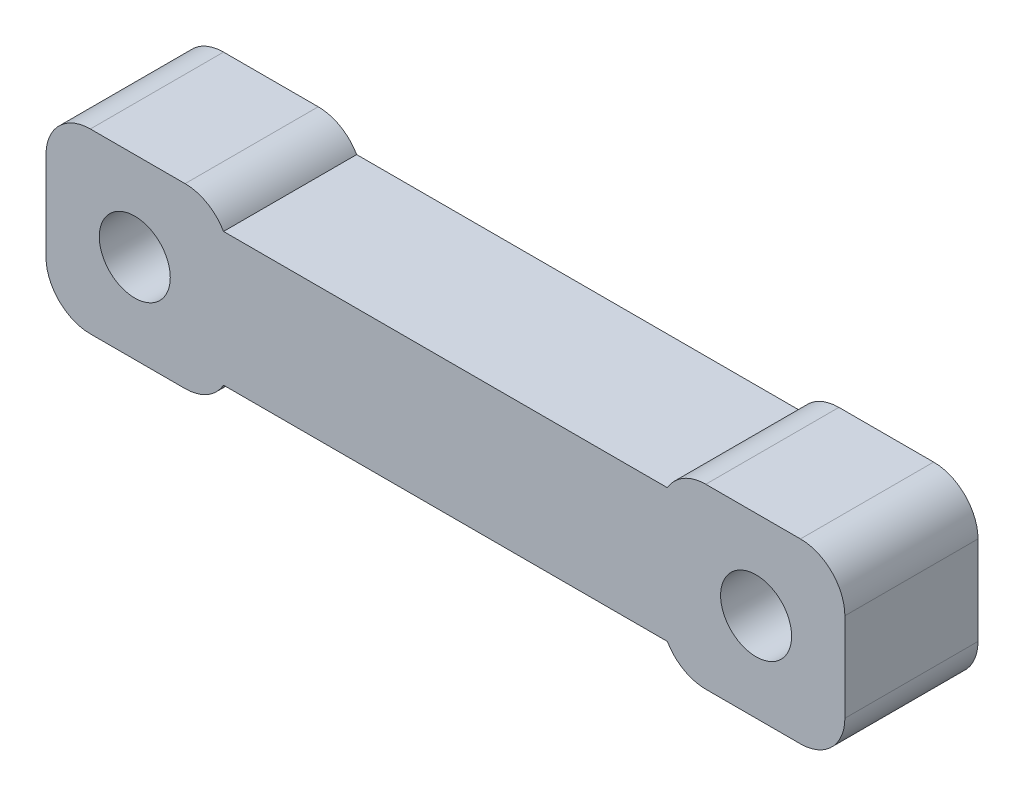
ISO-10303-21;
HEADER;
FILE_DESCRIPTION(('STEP AP214'),'2;1');
FILE_NAME('part.step','',(''),(''),'','','');
FILE_SCHEMA(('AUTOMOTIVE_DESIGN { 1 0 10303 214 1 1 1 1 }'));
ENDSEC;
DATA;
#1=APPLICATION_CONTEXT('core data for automotive mechanical design processes');
#2=APPLICATION_PROTOCOL_DEFINITION('international standard','automotive_design',2000,#1);
#3=PRODUCT_CONTEXT('',#1,'mechanical');
#4=PRODUCT('Part','Part','',(#3));
#5=PRODUCT_RELATED_PRODUCT_CATEGORY('part','',(#4));
#6=PRODUCT_DEFINITION_FORMATION('','',#4);
#7=PRODUCT_DEFINITION_CONTEXT('part definition',#1,'design');
#8=PRODUCT_DEFINITION('design','',#6,#7);
#9=PRODUCT_DEFINITION_SHAPE('','',#8);
#10=(LENGTH_UNIT() NAMED_UNIT(*) SI_UNIT(.MILLI.,.METRE.));
#11=(NAMED_UNIT(*) PLANE_ANGLE_UNIT() SI_UNIT($,.RADIAN.));
#12=(NAMED_UNIT(*) SI_UNIT($,.STERADIAN.) SOLID_ANGLE_UNIT());
#13=UNCERTAINTY_MEASURE_WITH_UNIT(LENGTH_MEASURE(1.E-05),#10,'distance_accuracy_value','');
#14=(GEOMETRIC_REPRESENTATION_CONTEXT(3) GLOBAL_UNCERTAINTY_ASSIGNED_CONTEXT((#13)) GLOBAL_UNIT_ASSIGNED_CONTEXT((#10,
#11,#12)) REPRESENTATION_CONTEXT('',''));
#15=CARTESIAN_POINT('',(0.,0.,0.));
#16=DIRECTION('',(0.,0.,1.));
#17=DIRECTION('',(1.,0.,0.));
#18=AXIS2_PLACEMENT_3D('',#15,#16,#17);
#19=CARTESIAN_POINT('',(0.,-2.,3.));
#20=DIRECTION('',(0.,-1.,0.));
#21=DIRECTION('',(1.,0.,0.));
#22=AXIS2_PLACEMENT_3D('',#19,#20,#21);
#23=PLANE('',#22);
#24=DIRECTION('',(-1.,0.,0.));
#25=VECTOR('',#24,1.);
#26=CARTESIAN_POINT('',(0.,-2.,3.));
#27=LINE('',#26,#25);
#28=CARTESIAN_POINT('',(8.,-2.,3.));
#29=VERTEX_POINT('',#28);
#30=CARTESIAN_POINT('',(5.86602540378444,-2.,3.));
#31=VERTEX_POINT('',#30);
#32=EDGE_CURVE('E285',#29,#31,#27,.T.);
#33=ORIENTED_EDGE('',*,*,#32,.T.);
#34=DIRECTION('',(0.,0.,1.));
#35=VECTOR('',#34,1.);
#36=CARTESIAN_POINT('',(5.86602540378444,-2.,0.));
#37=LINE('',#36,#35);
#38=CARTESIAN_POINT('',(5.86602540378444,-2.,0.));
#39=VERTEX_POINT('',#38);
#40=EDGE_CURVE('E179',#31,#39,#37,.F.);
#41=ORIENTED_EDGE('',*,*,#40,.T.);
#42=DIRECTION('',(-1.,0.,0.));
#43=VECTOR('',#42,1.);
#44=CARTESIAN_POINT('',(0.,-2.,0.));
#45=LINE('',#44,#43);
#46=CARTESIAN_POINT('',(8.,-2.,0.));
#47=VERTEX_POINT('',#46);
#48=EDGE_CURVE('E254',#47,#39,#45,.T.);
#49=ORIENTED_EDGE('',*,*,#48,.F.);
#50=DIRECTION('',(0.,0.,-1.));
#51=VECTOR('',#50,1.);
#52=CARTESIAN_POINT('',(8.,-2.,3.));
#53=LINE('',#52,#51);
#54=EDGE_CURVE('E177',#47,#29,#53,.F.);
#55=ORIENTED_EDGE('',*,*,#54,.T.);
#56=EDGE_LOOP('',(#33,#41,#49,#55));
#57=FACE_BOUND('',#56,.T.);
#58=ADVANCED_FACE('F38',(#57),#23,.T.);
#59=CARTESIAN_POINT('',(9.,0.,3.));
#60=DIRECTION('',(-1.,0.,0.));
#61=DIRECTION('',(0.,0.,1.));
#62=AXIS2_PLACEMENT_3D('',#59,#60,#61);
#63=PLANE('',#62);
#64=DIRECTION('',(0.,1.,0.));
#65=VECTOR('',#64,1.);
#66=CARTESIAN_POINT('',(9.,0.,3.));
#67=LINE('',#66,#65);
#68=CARTESIAN_POINT('',(9.,-0.999999999999999,3.));
#69=VERTEX_POINT('',#68);
#70=CARTESIAN_POINT('',(9.,1.,3.));
#71=VERTEX_POINT('',#70);
#72=EDGE_CURVE('E287',#69,#71,#67,.T.);
#73=ORIENTED_EDGE('',*,*,#72,.F.);
#74=DIRECTION('',(0.,0.,-1.));
#75=VECTOR('',#74,1.);
#76=CARTESIAN_POINT('',(9.,-0.999999999999999,0.));
#77=LINE('',#76,#75);
#78=CARTESIAN_POINT('',(9.,-0.999999999999999,0.));
#79=VERTEX_POINT('',#78);
#80=EDGE_CURVE('E215',#69,#79,#77,.T.);
#81=ORIENTED_EDGE('',*,*,#80,.T.);
#82=DIRECTION('',(0.,1.,0.));
#83=VECTOR('',#82,1.);
#84=CARTESIAN_POINT('',(9.,0.,0.));
#85=LINE('',#84,#83);
#86=CARTESIAN_POINT('',(9.,1.,0.));
#87=VERTEX_POINT('',#86);
#88=EDGE_CURVE('E307',#79,#87,#85,.T.);
#89=ORIENTED_EDGE('',*,*,#88,.T.);
#90=DIRECTION('',(0.,0.,-1.));
#91=VECTOR('',#90,1.);
#92=CARTESIAN_POINT('',(9.,1.,3.));
#93=LINE('',#92,#91);
#94=EDGE_CURVE('E213',#87,#71,#93,.F.);
#95=ORIENTED_EDGE('',*,*,#94,.T.);
#96=EDGE_LOOP('',(#73,#81,#89,#95));
#97=FACE_BOUND('',#96,.T.);
#98=ADVANCED_FACE('F335',(#97),#63,.F.);
#99=CARTESIAN_POINT('',(0.,2.,3.));
#100=DIRECTION('',(0.,-1.,0.));
#101=DIRECTION('',(1.,0.,0.));
#102=AXIS2_PLACEMENT_3D('',#99,#100,#101);
#103=PLANE('',#102);
#104=DIRECTION('',(-1.,0.,0.));
#105=VECTOR('',#104,1.);
#106=CARTESIAN_POINT('',(0.,2.,3.));
#107=LINE('',#106,#105);
#108=CARTESIAN_POINT('',(8.,2.,3.));
#109=VERTEX_POINT('',#108);
#110=CARTESIAN_POINT('',(5.86602540378444,2.,3.));
#111=VERTEX_POINT('',#110);
#112=EDGE_CURVE('E158',#109,#111,#107,.T.);
#113=ORIENTED_EDGE('',*,*,#112,.F.);
#114=DIRECTION('',(0.,0.,-1.));
#115=VECTOR('',#114,1.);
#116=CARTESIAN_POINT('',(8.,2.,3.));
#117=LINE('',#116,#115);
#118=CARTESIAN_POINT('',(8.,2.,0.));
#119=VERTEX_POINT('',#118);
#120=EDGE_CURVE('E220',#109,#119,#117,.T.);
#121=ORIENTED_EDGE('',*,*,#120,.T.);
#122=DIRECTION('',(-1.,0.,0.));
#123=VECTOR('',#122,1.);
#124=CARTESIAN_POINT('',(0.,2.,0.));
#125=LINE('',#124,#123);
#126=CARTESIAN_POINT('',(5.86602540378444,2.,0.));
#127=VERTEX_POINT('',#126);
#128=EDGE_CURVE('E257',#119,#127,#125,.T.);
#129=ORIENTED_EDGE('',*,*,#128,.T.);
#130=DIRECTION('',(0.,0.,1.));
#131=VECTOR('',#130,1.);
#132=CARTESIAN_POINT('',(5.86602540378444,2.,3.));
#133=LINE('',#132,#131);
#134=EDGE_CURVE('E218',#127,#111,#133,.T.);
#135=ORIENTED_EDGE('',*,*,#134,.T.);
#136=EDGE_LOOP('',(#113,#121,#129,#135));
#137=FACE_BOUND('',#136,.T.);
#138=ADVANCED_FACE('F339',(#137),#103,.F.);
#139=CARTESIAN_POINT('',(0.,1.5,3.));
#140=DIRECTION('',(0.,1.,0.));
#141=DIRECTION('',(0.,0.,1.));
#142=AXIS2_PLACEMENT_3D('',#139,#140,#141);
#143=PLANE('',#142);
#144=DIRECTION('',(1.,0.,0.));
#145=VECTOR('',#144,1.);
#146=CARTESIAN_POINT('',(0.,1.5,0.));
#147=LINE('',#146,#145);
#148=CARTESIAN_POINT('',(-5.,1.5,0.));
#149=VERTEX_POINT('',#148);
#150=CARTESIAN_POINT('',(5.,1.5,0.));
#151=VERTEX_POINT('',#150);
#152=EDGE_CURVE('E255',#149,#151,#147,.T.);
#153=ORIENTED_EDGE('',*,*,#152,.F.);
#154=DIRECTION('',(0.,0.,-1.));
#155=VECTOR('',#154,1.);
#156=CARTESIAN_POINT('',(-5.,1.5,3.));
#157=LINE('',#156,#155);
#158=CARTESIAN_POINT('',(-5.,1.5,3.));
#159=VERTEX_POINT('',#158);
#160=EDGE_CURVE('E172',#159,#149,#157,.T.);
#161=ORIENTED_EDGE('',*,*,#160,.F.);
#162=DIRECTION('',(1.,0.,0.));
#163=VECTOR('',#162,1.);
#164=CARTESIAN_POINT('',(0.,1.5,3.));
#165=LINE('',#164,#163);
#166=CARTESIAN_POINT('',(5.,1.5,3.));
#167=VERTEX_POINT('',#166);
#168=EDGE_CURVE('E155',#159,#167,#165,.T.);
#169=ORIENTED_EDGE('',*,*,#168,.T.);
#170=DIRECTION('',(0.,0.,-1.));
#171=VECTOR('',#170,1.);
#172=CARTESIAN_POINT('',(5.,1.5,3.));
#173=LINE('',#172,#171);
#174=EDGE_CURVE('E169',#167,#151,#173,.T.);
#175=ORIENTED_EDGE('',*,*,#174,.T.);
#176=EDGE_LOOP('',(#153,#161,#169,#175));
#177=FACE_BOUND('',#176,.T.);
#178=ADVANCED_FACE('F168',(#177),#143,.T.);
#179=CARTESIAN_POINT('',(-5.86602540378444,2.,3.));
#180=VERTEX_POINT('',#179);
#181=CARTESIAN_POINT('',(-8.,2.,3.));
#182=VERTEX_POINT('',#181);
#183=EDGE_CURVE('E173',#180,#182,#107,.T.);
#184=ORIENTED_EDGE('',*,*,#183,.F.);
#185=DIRECTION('',(0.,0.,1.));
#186=VECTOR('',#185,1.);
#187=CARTESIAN_POINT('',(-5.86602540378444,2.,3.));
#188=LINE('',#187,#186);
#189=CARTESIAN_POINT('',(-5.86602540378444,2.,0.));
#190=VERTEX_POINT('',#189);
#191=EDGE_CURVE('E229',#180,#190,#188,.F.);
#192=ORIENTED_EDGE('',*,*,#191,.T.);
#193=CARTESIAN_POINT('',(-8.,2.,0.));
#194=VERTEX_POINT('',#193);
#195=EDGE_CURVE('E250',#190,#194,#125,.T.);
#196=ORIENTED_EDGE('',*,*,#195,.T.);
#197=DIRECTION('',(0.,0.,-1.));
#198=VECTOR('',#197,1.);
#199=CARTESIAN_POINT('',(-8.,2.,3.));
#200=LINE('',#199,#198);
#201=EDGE_CURVE('E227',#194,#182,#200,.F.);
#202=ORIENTED_EDGE('',*,*,#201,.T.);
#203=EDGE_LOOP('',(#184,#192,#196,#202));
#204=FACE_BOUND('',#203,.T.);
#205=ADVANCED_FACE('F317',(#204),#103,.F.);
#206=CARTESIAN_POINT('',(-9.,0.,3.));
#207=DIRECTION('',(-1.,0.,0.));
#208=DIRECTION('',(0.,0.,1.));
#209=AXIS2_PLACEMENT_3D('',#206,#207,#208);
#210=PLANE('',#209);
#211=DIRECTION('',(0.,1.,0.));
#212=VECTOR('',#211,1.);
#213=CARTESIAN_POINT('',(-9.,0.,0.));
#214=LINE('',#213,#212);
#215=CARTESIAN_POINT('',(-9.,-1.,0.));
#216=VERTEX_POINT('',#215);
#217=CARTESIAN_POINT('',(-9.,1.,0.));
#218=VERTEX_POINT('',#217);
#219=EDGE_CURVE('E238',#216,#218,#214,.T.);
#220=ORIENTED_EDGE('',*,*,#219,.F.);
#221=DIRECTION('',(0.,0.,-1.));
#222=VECTOR('',#221,1.);
#223=CARTESIAN_POINT('',(-9.,-1.,3.));
#224=LINE('',#223,#222);
#225=CARTESIAN_POINT('',(-9.,-1.,3.));
#226=VERTEX_POINT('',#225);
#227=EDGE_CURVE('E11',#216,#226,#224,.F.);
#228=ORIENTED_EDGE('',*,*,#227,.T.);
#229=DIRECTION('',(0.,1.,0.));
#230=VECTOR('',#229,1.);
#231=CARTESIAN_POINT('',(-9.,0.,3.));
#232=LINE('',#231,#230);
#233=CARTESIAN_POINT('',(-9.,1.,3.));
#234=VERTEX_POINT('',#233);
#235=EDGE_CURVE('E240',#226,#234,#232,.T.);
#236=ORIENTED_EDGE('',*,*,#235,.T.);
#237=DIRECTION('',(0.,0.,-1.));
#238=VECTOR('',#237,1.);
#239=CARTESIAN_POINT('',(-9.,1.,0.));
#240=LINE('',#239,#238);
#241=EDGE_CURVE('E46',#234,#218,#240,.T.);
#242=ORIENTED_EDGE('',*,*,#241,.T.);
#243=EDGE_LOOP('',(#220,#228,#236,#242));
#244=FACE_BOUND('',#243,.T.);
#245=ADVANCED_FACE('F237',(#244),#210,.T.);
#246=CARTESIAN_POINT('',(-5.86602540378444,-2.,0.));
#247=VERTEX_POINT('',#246);
#248=CARTESIAN_POINT('',(-8.,-2.,0.));
#249=VERTEX_POINT('',#248);
#250=EDGE_CURVE('E249',#247,#249,#45,.T.);
#251=ORIENTED_EDGE('',*,*,#250,.F.);
#252=DIRECTION('',(0.,0.,1.));
#253=VECTOR('',#252,1.);
#254=CARTESIAN_POINT('',(-5.86602540378444,-2.,3.));
#255=LINE('',#254,#253);
#256=CARTESIAN_POINT('',(-5.86602540378444,-2.,3.));
#257=VERTEX_POINT('',#256);
#258=EDGE_CURVE('E60',#247,#257,#255,.T.);
#259=ORIENTED_EDGE('',*,*,#258,.T.);
#260=CARTESIAN_POINT('',(-8.,-2.,3.));
#261=VERTEX_POINT('',#260);
#262=EDGE_CURVE('E290',#257,#261,#27,.T.);
#263=ORIENTED_EDGE('',*,*,#262,.T.);
#264=DIRECTION('',(0.,0.,-1.));
#265=VECTOR('',#264,1.);
#266=CARTESIAN_POINT('',(-8.,-2.,3.));
#267=LINE('',#266,#265);
#268=EDGE_CURVE('E223',#261,#249,#267,.T.);
#269=ORIENTED_EDGE('',*,*,#268,.T.);
#270=EDGE_LOOP('',(#251,#259,#263,#269));
#271=FACE_BOUND('',#270,.T.);
#272=ADVANCED_FACE('F321',(#271),#23,.T.);
#273=CARTESIAN_POINT('',(7.,0.,3.));
#274=DIRECTION('',(0.,0.,-1.));
#275=DIRECTION('',(-1.,0.,0.));
#276=AXIS2_PLACEMENT_3D('',#273,#274,#275);
#277=CYLINDRICAL_SURFACE('',#276,0.800000000000001);
#278=CARTESIAN_POINT('',(7.,0.,3.));
#279=DIRECTION('',(0.,0.,1.));
#280=DIRECTION('',(1.,0.,0.));
#281=AXIS2_PLACEMENT_3D('',#278,#279,#280);
#282=CIRCLE('',#281,0.800000000000001);
#283=CARTESIAN_POINT('',(7.8,0.,3.));
#284=VERTEX_POINT('',#283);
#285=EDGE_CURVE('E288',#284,#284,#282,.T.);
#286=ORIENTED_EDGE('',*,*,#285,.T.);
#287=EDGE_LOOP('',(#286));
#288=FACE_BOUND('',#287,.T.);
#289=CARTESIAN_POINT('',(7.,0.,0.));
#290=DIRECTION('',(0.,0.,1.));
#291=DIRECTION('',(1.,0.,0.));
#292=AXIS2_PLACEMENT_3D('',#289,#290,#291);
#293=CIRCLE('',#292,0.800000000000001);
#294=CARTESIAN_POINT('',(7.8,0.,0.));
#295=VERTEX_POINT('',#294);
#296=EDGE_CURVE('E304',#295,#295,#293,.T.);
#297=ORIENTED_EDGE('',*,*,#296,.F.);
#298=EDGE_LOOP('',(#297));
#299=FACE_BOUND('',#298,.T.);
#300=ADVANCED_FACE('F323',(#288,#299),#277,.F.);
#301=CARTESIAN_POINT('',(-7.,0.,3.));
#302=DIRECTION('',(0.,0.,-1.));
#303=DIRECTION('',(-1.,0.,0.));
#304=AXIS2_PLACEMENT_3D('',#301,#302,#303);
#305=CYLINDRICAL_SURFACE('',#304,0.800000000000001);
#306=CARTESIAN_POINT('',(-7.,0.,3.));
#307=DIRECTION('',(0.,0.,1.));
#308=DIRECTION('',(1.,0.,0.));
#309=AXIS2_PLACEMENT_3D('',#306,#307,#308);
#310=CIRCLE('',#309,0.800000000000001);
#311=CARTESIAN_POINT('',(-6.2,0.,3.));
#312=VERTEX_POINT('',#311);
#313=EDGE_CURVE('E262',#312,#312,#310,.T.);
#314=ORIENTED_EDGE('',*,*,#313,.T.);
#315=EDGE_LOOP('',(#314));
#316=FACE_BOUND('',#315,.T.);
#317=CARTESIAN_POINT('',(-7.,0.,0.));
#318=DIRECTION('',(0.,0.,1.));
#319=DIRECTION('',(1.,0.,0.));
#320=AXIS2_PLACEMENT_3D('',#317,#318,#319);
#321=CIRCLE('',#320,0.800000000000001);
#322=CARTESIAN_POINT('',(-6.2,0.,0.));
#323=VERTEX_POINT('',#322);
#324=EDGE_CURVE('E301',#323,#323,#321,.T.);
#325=ORIENTED_EDGE('',*,*,#324,.F.);
#326=EDGE_LOOP('',(#325));
#327=FACE_BOUND('',#326,.T.);
#328=ADVANCED_FACE('F329',(#316,#327),#305,.F.);
#329=CARTESIAN_POINT('',(0.,-1.5,3.));
#330=DIRECTION('',(0.,1.,0.));
#331=DIRECTION('',(-1.,0.,0.));
#332=AXIS2_PLACEMENT_3D('',#329,#330,#331);
#333=PLANE('',#332);
#334=DIRECTION('',(1.,0.,0.));
#335=VECTOR('',#334,1.);
#336=CARTESIAN_POINT('',(0.,-1.5,0.));
#337=LINE('',#336,#335);
#338=CARTESIAN_POINT('',(-5.,-1.5,0.));
#339=VERTEX_POINT('',#338);
#340=CARTESIAN_POINT('',(5.,-1.5,0.));
#341=VERTEX_POINT('',#340);
#342=EDGE_CURVE('E252',#339,#341,#337,.T.);
#343=ORIENTED_EDGE('',*,*,#342,.T.);
#344=DIRECTION('',(0.,0.,-1.));
#345=VECTOR('',#344,1.);
#346=CARTESIAN_POINT('',(5.,-1.5,3.));
#347=LINE('',#346,#345);
#348=CARTESIAN_POINT('',(5.,-1.5,3.));
#349=VERTEX_POINT('',#348);
#350=EDGE_CURVE('E263',#349,#341,#347,.T.);
#351=ORIENTED_EDGE('',*,*,#350,.F.);
#352=DIRECTION('',(1.,0.,0.));
#353=VECTOR('',#352,1.);
#354=CARTESIAN_POINT('',(0.,-1.5,3.));
#355=LINE('',#354,#353);
#356=CARTESIAN_POINT('',(-5.,-1.5,3.));
#357=VERTEX_POINT('',#356);
#358=EDGE_CURVE('E265',#357,#349,#355,.T.);
#359=ORIENTED_EDGE('',*,*,#358,.F.);
#360=DIRECTION('',(0.,0.,-1.));
#361=VECTOR('',#360,1.);
#362=CARTESIAN_POINT('',(-5.,-1.5,3.));
#363=LINE('',#362,#361);
#364=EDGE_CURVE('E181',#357,#339,#363,.T.);
#365=ORIENTED_EDGE('',*,*,#364,.T.);
#366=EDGE_LOOP('',(#343,#351,#359,#365));
#367=FACE_BOUND('',#366,.T.);
#368=ADVANCED_FACE('F270',(#367),#333,.F.);
#369=CARTESIAN_POINT('',(0.,0.,3.));
#370=DIRECTION('',(0.,0.,1.));
#371=DIRECTION('',(1.,0.,0.));
#372=AXIS2_PLACEMENT_3D('',#369,#370,#371);
#373=PLANE('',#372);
#374=ORIENTED_EDGE('',*,*,#313,.F.);
#375=EDGE_LOOP('',(#374));
#376=FACE_BOUND('',#375,.T.);
#377=ORIENTED_EDGE('',*,*,#285,.F.);
#378=EDGE_LOOP('',(#377));
#379=FACE_BOUND('',#378,.T.);
#380=ORIENTED_EDGE('',*,*,#358,.T.);
#381=CARTESIAN_POINT('',(5.86602540378444,-0.999999999999999,3.));
#382=DIRECTION('',(0.,0.,1.));
#383=DIRECTION('',(1.,0.,0.));
#384=AXIS2_PLACEMENT_3D('',#381,#382,#383);
#385=CIRCLE('',#384,1.);
#386=EDGE_CURVE('E211',#349,#31,#385,.T.);
#387=ORIENTED_EDGE('',*,*,#386,.T.);
#388=ORIENTED_EDGE('',*,*,#32,.F.);
#389=CARTESIAN_POINT('',(8.,-0.999999999999999,3.));
#390=DIRECTION('',(0.,0.,1.));
#391=DIRECTION('',(1.,0.,0.));
#392=AXIS2_PLACEMENT_3D('',#389,#390,#391);
#393=CIRCLE('',#392,1.);
#394=EDGE_CURVE('E209',#29,#69,#393,.T.);
#395=ORIENTED_EDGE('',*,*,#394,.T.);
#396=ORIENTED_EDGE('',*,*,#72,.T.);
#397=CARTESIAN_POINT('',(8.,1.,3.));
#398=DIRECTION('',(0.,0.,1.));
#399=DIRECTION('',(1.,0.,0.));
#400=AXIS2_PLACEMENT_3D('',#397,#398,#399);
#401=CIRCLE('',#400,1.);
#402=EDGE_CURVE('E162',#71,#109,#401,.T.);
#403=ORIENTED_EDGE('',*,*,#402,.T.);
#404=ORIENTED_EDGE('',*,*,#112,.T.);
#405=CARTESIAN_POINT('',(5.86602540378444,1.,3.));
#406=DIRECTION('',(0.,0.,1.));
#407=DIRECTION('',(1.,0.,0.));
#408=AXIS2_PLACEMENT_3D('',#405,#406,#407);
#409=CIRCLE('',#408,1.);
#410=EDGE_CURVE('E152',#111,#167,#409,.T.);
#411=ORIENTED_EDGE('',*,*,#410,.T.);
#412=ORIENTED_EDGE('',*,*,#168,.F.);
#413=CARTESIAN_POINT('',(-5.86602540378444,1.,3.));
#414=DIRECTION('',(0.,0.,1.));
#415=DIRECTION('',(1.,0.,0.));
#416=AXIS2_PLACEMENT_3D('',#413,#414,#415);
#417=CIRCLE('',#416,1.);
#418=EDGE_CURVE('E205',#159,#180,#417,.T.);
#419=ORIENTED_EDGE('',*,*,#418,.T.);
#420=ORIENTED_EDGE('',*,*,#183,.T.);
#421=CARTESIAN_POINT('',(-8.,1.,3.));
#422=DIRECTION('',(0.,0.,1.));
#423=DIRECTION('',(1.,0.,0.));
#424=AXIS2_PLACEMENT_3D('',#421,#422,#423);
#425=CIRCLE('',#424,1.);
#426=EDGE_CURVE('E202',#182,#234,#425,.T.);
#427=ORIENTED_EDGE('',*,*,#426,.T.);
#428=ORIENTED_EDGE('',*,*,#235,.F.);
#429=CARTESIAN_POINT('',(-8.,-1.,3.));
#430=DIRECTION('',(0.,0.,1.));
#431=DIRECTION('',(1.,0.,0.));
#432=AXIS2_PLACEMENT_3D('',#429,#430,#431);
#433=CIRCLE('',#432,1.);
#434=EDGE_CURVE('E53',#226,#261,#433,.T.);
#435=ORIENTED_EDGE('',*,*,#434,.T.);
#436=ORIENTED_EDGE('',*,*,#262,.F.);
#437=CARTESIAN_POINT('',(-5.86602540378444,-1.,3.));
#438=DIRECTION('',(0.,0.,1.));
#439=DIRECTION('',(1.,0.,0.));
#440=AXIS2_PLACEMENT_3D('',#437,#438,#439);
#441=CIRCLE('',#440,1.);
#442=EDGE_CURVE('E163',#257,#357,#441,.T.);
#443=ORIENTED_EDGE('',*,*,#442,.T.);
#444=EDGE_LOOP('',(#380,#387,#388,#395,#396,#403,#404,#411,#412,#419,#420,#427,#428,#435,#436,#443));
#445=FACE_BOUND('',#444,.T.);
#446=ADVANCED_FACE('F154',(#376,#379,#445),#373,.T.);
#447=CARTESIAN_POINT('',(0.,0.,0.));
#448=DIRECTION('',(0.,0.,1.));
#449=DIRECTION('',(1.,0.,0.));
#450=AXIS2_PLACEMENT_3D('',#447,#448,#449);
#451=PLANE('',#450);
#452=ORIENTED_EDGE('',*,*,#324,.T.);
#453=EDGE_LOOP('',(#452));
#454=FACE_BOUND('',#453,.T.);
#455=ORIENTED_EDGE('',*,*,#296,.T.);
#456=EDGE_LOOP('',(#455));
#457=FACE_BOUND('',#456,.T.);
#458=ORIENTED_EDGE('',*,*,#48,.T.);
#459=CARTESIAN_POINT('',(5.86602540378444,-0.999999999999999,0.));
#460=DIRECTION('',(0.,0.,1.));
#461=DIRECTION('',(1.,0.,0.));
#462=AXIS2_PLACEMENT_3D('',#459,#460,#461);
#463=CIRCLE('',#462,1.);
#464=EDGE_CURVE('E200',#39,#341,#463,.F.);
#465=ORIENTED_EDGE('',*,*,#464,.T.);
#466=ORIENTED_EDGE('',*,*,#342,.F.);
#467=CARTESIAN_POINT('',(-5.86602540378444,-1.,0.));
#468=DIRECTION('',(0.,0.,1.));
#469=DIRECTION('',(1.,0.,0.));
#470=AXIS2_PLACEMENT_3D('',#467,#468,#469);
#471=CIRCLE('',#470,1.);
#472=EDGE_CURVE('E193',#339,#247,#471,.F.);
#473=ORIENTED_EDGE('',*,*,#472,.T.);
#474=ORIENTED_EDGE('',*,*,#250,.T.);
#475=CARTESIAN_POINT('',(-8.,-1.,0.));
#476=DIRECTION('',(0.,0.,1.));
#477=DIRECTION('',(1.,0.,0.));
#478=AXIS2_PLACEMENT_3D('',#475,#476,#477);
#479=CIRCLE('',#478,1.);
#480=EDGE_CURVE('E189',#249,#216,#479,.F.);
#481=ORIENTED_EDGE('',*,*,#480,.T.);
#482=ORIENTED_EDGE('',*,*,#219,.T.);
#483=CARTESIAN_POINT('',(-8.,1.,0.));
#484=DIRECTION('',(0.,0.,1.));
#485=DIRECTION('',(1.,0.,0.));
#486=AXIS2_PLACEMENT_3D('',#483,#484,#485);
#487=CIRCLE('',#486,1.);
#488=EDGE_CURVE('E187',#218,#194,#487,.F.);
#489=ORIENTED_EDGE('',*,*,#488,.T.);
#490=ORIENTED_EDGE('',*,*,#195,.F.);
#491=CARTESIAN_POINT('',(-5.86602540378444,1.,0.));
#492=DIRECTION('',(0.,0.,1.));
#493=DIRECTION('',(1.,0.,0.));
#494=AXIS2_PLACEMENT_3D('',#491,#492,#493);
#495=CIRCLE('',#494,1.);
#496=EDGE_CURVE('E191',#190,#149,#495,.F.);
#497=ORIENTED_EDGE('',*,*,#496,.T.);
#498=ORIENTED_EDGE('',*,*,#152,.T.);
#499=CARTESIAN_POINT('',(5.86602540378444,1.,0.));
#500=DIRECTION('',(0.,0.,1.));
#501=DIRECTION('',(1.,0.,0.));
#502=AXIS2_PLACEMENT_3D('',#499,#500,#501);
#503=CIRCLE('',#502,1.);
#504=EDGE_CURVE('E176',#151,#127,#503,.F.);
#505=ORIENTED_EDGE('',*,*,#504,.T.);
#506=ORIENTED_EDGE('',*,*,#128,.F.);
#507=CARTESIAN_POINT('',(8.,1.,0.));
#508=DIRECTION('',(0.,0.,1.));
#509=DIRECTION('',(1.,0.,0.));
#510=AXIS2_PLACEMENT_3D('',#507,#508,#509);
#511=CIRCLE('',#510,1.);
#512=EDGE_CURVE('E196',#119,#87,#511,.F.);
#513=ORIENTED_EDGE('',*,*,#512,.T.);
#514=ORIENTED_EDGE('',*,*,#88,.F.);
#515=CARTESIAN_POINT('',(8.,-0.999999999999999,0.));
#516=DIRECTION('',(0.,0.,1.));
#517=DIRECTION('',(1.,0.,0.));
#518=AXIS2_PLACEMENT_3D('',#515,#516,#517);
#519=CIRCLE('',#518,1.);
#520=EDGE_CURVE('E198',#79,#47,#519,.F.);
#521=ORIENTED_EDGE('',*,*,#520,.T.);
#522=EDGE_LOOP('',(#458,#465,#466,#473,#474,#481,#482,#489,#490,#497,#498,#505,#506,#513,#514,#521));
#523=FACE_BOUND('',#522,.T.);
#524=ADVANCED_FACE('F245',(#454,#457,#523),#451,.F.);
#525=CARTESIAN_POINT('',(5.86602540378444,-0.999999999999999,3.));
#526=DIRECTION('',(0.,0.,-1.));
#527=DIRECTION('',(-1.,0.,0.));
#528=AXIS2_PLACEMENT_3D('',#525,#526,#527);
#529=CYLINDRICAL_SURFACE('',#528,1.);
#530=ORIENTED_EDGE('',*,*,#386,.F.);
#531=ORIENTED_EDGE('',*,*,#350,.T.);
#532=ORIENTED_EDGE('',*,*,#464,.F.);
#533=ORIENTED_EDGE('',*,*,#40,.F.);
#534=EDGE_LOOP('',(#530,#531,#532,#533));
#535=FACE_BOUND('',#534,.T.);
#536=ADVANCED_FACE('F280',(#535),#529,.T.);
#537=CARTESIAN_POINT('',(8.,-0.999999999999999,3.));
#538=DIRECTION('',(0.,0.,1.));
#539=DIRECTION('',(1.,0.,0.));
#540=AXIS2_PLACEMENT_3D('',#537,#538,#539);
#541=CYLINDRICAL_SURFACE('',#540,1.);
#542=ORIENTED_EDGE('',*,*,#394,.F.);
#543=ORIENTED_EDGE('',*,*,#54,.F.);
#544=ORIENTED_EDGE('',*,*,#520,.F.);
#545=ORIENTED_EDGE('',*,*,#80,.F.);
#546=EDGE_LOOP('',(#542,#543,#544,#545));
#547=FACE_BOUND('',#546,.T.);
#548=ADVANCED_FACE('F354',(#547),#541,.T.);
#549=CARTESIAN_POINT('',(8.,1.,3.));
#550=DIRECTION('',(0.,0.,-1.));
#551=DIRECTION('',(-1.,0.,0.));
#552=AXIS2_PLACEMENT_3D('',#549,#550,#551);
#553=CYLINDRICAL_SURFACE('',#552,1.);
#554=ORIENTED_EDGE('',*,*,#402,.F.);
#555=ORIENTED_EDGE('',*,*,#94,.F.);
#556=ORIENTED_EDGE('',*,*,#512,.F.);
#557=ORIENTED_EDGE('',*,*,#120,.F.);
#558=EDGE_LOOP('',(#554,#555,#556,#557));
#559=FACE_BOUND('',#558,.T.);
#560=ADVANCED_FACE('F357',(#559),#553,.T.);
#561=CARTESIAN_POINT('',(5.86602540378444,1.,3.));
#562=DIRECTION('',(0.,0.,1.));
#563=DIRECTION('',(1.,0.,0.));
#564=AXIS2_PLACEMENT_3D('',#561,#562,#563);
#565=CYLINDRICAL_SURFACE('',#564,1.);
#566=ORIENTED_EDGE('',*,*,#410,.F.);
#567=ORIENTED_EDGE('',*,*,#134,.F.);
#568=ORIENTED_EDGE('',*,*,#504,.F.);
#569=ORIENTED_EDGE('',*,*,#174,.F.);
#570=EDGE_LOOP('',(#566,#567,#568,#569));
#571=FACE_BOUND('',#570,.T.);
#572=ADVANCED_FACE('F175',(#571),#565,.T.);
#573=CARTESIAN_POINT('',(-5.86602540378444,-1.,3.));
#574=DIRECTION('',(0.,0.,-1.));
#575=DIRECTION('',(-1.,0.,0.));
#576=AXIS2_PLACEMENT_3D('',#573,#574,#575);
#577=CYLINDRICAL_SURFACE('',#576,1.);
#578=ORIENTED_EDGE('',*,*,#442,.F.);
#579=ORIENTED_EDGE('',*,*,#258,.F.);
#580=ORIENTED_EDGE('',*,*,#472,.F.);
#581=ORIENTED_EDGE('',*,*,#364,.F.);
#582=EDGE_LOOP('',(#578,#579,#580,#581));
#583=FACE_BOUND('',#582,.T.);
#584=ADVANCED_FACE('F275',(#583),#577,.T.);
#585=CARTESIAN_POINT('',(-5.86602540378444,1.,3.));
#586=DIRECTION('',(0.,0.,1.));
#587=DIRECTION('',(1.,0.,0.));
#588=AXIS2_PLACEMENT_3D('',#585,#586,#587);
#589=CYLINDRICAL_SURFACE('',#588,1.);
#590=ORIENTED_EDGE('',*,*,#418,.F.);
#591=ORIENTED_EDGE('',*,*,#160,.T.);
#592=ORIENTED_EDGE('',*,*,#496,.F.);
#593=ORIENTED_EDGE('',*,*,#191,.F.);
#594=EDGE_LOOP('',(#590,#591,#592,#593));
#595=FACE_BOUND('',#594,.T.);
#596=ADVANCED_FACE('F313',(#595),#589,.T.);
#597=CARTESIAN_POINT('',(-8.,-1.,3.));
#598=DIRECTION('',(0.,0.,-1.));
#599=DIRECTION('',(-1.,0.,0.));
#600=AXIS2_PLACEMENT_3D('',#597,#598,#599);
#601=CYLINDRICAL_SURFACE('',#600,1.);
#602=ORIENTED_EDGE('',*,*,#434,.F.);
#603=ORIENTED_EDGE('',*,*,#227,.F.);
#604=ORIENTED_EDGE('',*,*,#480,.F.);
#605=ORIENTED_EDGE('',*,*,#268,.F.);
#606=EDGE_LOOP('',(#602,#603,#604,#605));
#607=FACE_BOUND('',#606,.T.);
#608=ADVANCED_FACE('F320',(#607),#601,.T.);
#609=CARTESIAN_POINT('',(-8.,1.,3.));
#610=DIRECTION('',(0.,0.,1.));
#611=DIRECTION('',(1.,0.,0.));
#612=AXIS2_PLACEMENT_3D('',#609,#610,#611);
#613=CYLINDRICAL_SURFACE('',#612,1.);
#614=ORIENTED_EDGE('',*,*,#426,.F.);
#615=ORIENTED_EDGE('',*,*,#201,.F.);
#616=ORIENTED_EDGE('',*,*,#488,.F.);
#617=ORIENTED_EDGE('',*,*,#241,.F.);
#618=EDGE_LOOP('',(#614,#615,#616,#617));
#619=FACE_BOUND('',#618,.T.);
#620=ADVANCED_FACE('F40',(#619),#613,.T.);
#621=CLOSED_SHELL('',(#58,#98,#138,#178,#205,#245,#272,#300,#328,#368,#446,#524,#536,#548,#560,
#572,#584,#596,#608,#620));
#622=MANIFOLD_SOLID_BREP('B2',#621);
#623=ADVANCED_BREP_SHAPE_REPRESENTATION('',(#18,#622),#14);
#624=SHAPE_DEFINITION_REPRESENTATION(#9,#623);
ENDSEC;
END-ISO-10303-21;
